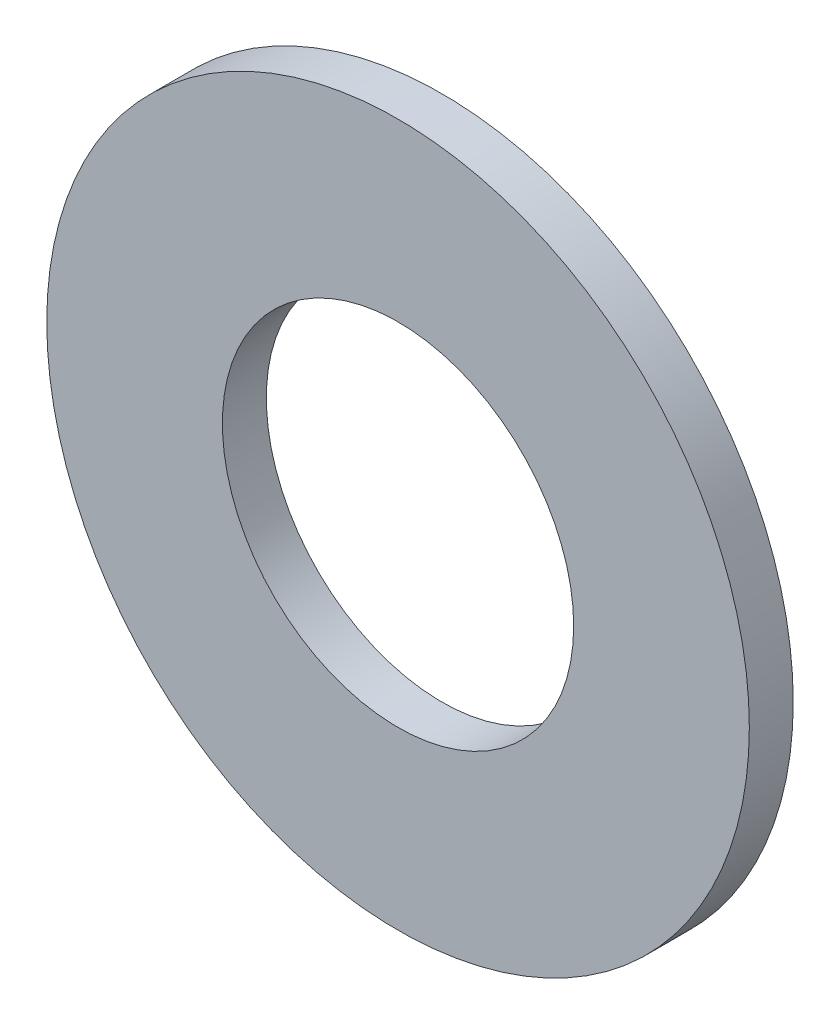
ISO-10303-21;
HEADER;
FILE_DESCRIPTION(('STEP AP214'),'2;1');
FILE_NAME('part.step','',(''),(''),'','','');
FILE_SCHEMA(('AUTOMOTIVE_DESIGN { 1 0 10303 214 1 1 1 1 }'));
ENDSEC;
DATA;
#1=APPLICATION_CONTEXT('core data for automotive mechanical design processes');
#2=APPLICATION_PROTOCOL_DEFINITION('international standard','automotive_design',2000,#1);
#3=PRODUCT_CONTEXT('',#1,'mechanical');
#4=PRODUCT('Part','Part','',(#3));
#5=PRODUCT_RELATED_PRODUCT_CATEGORY('part','',(#4));
#6=PRODUCT_DEFINITION_FORMATION('','',#4);
#7=PRODUCT_DEFINITION_CONTEXT('part definition',#1,'design');
#8=PRODUCT_DEFINITION('design','',#6,#7);
#9=PRODUCT_DEFINITION_SHAPE('','',#8);
#10=(LENGTH_UNIT() NAMED_UNIT(*) SI_UNIT(.MILLI.,.METRE.));
#11=(NAMED_UNIT(*) PLANE_ANGLE_UNIT() SI_UNIT($,.RADIAN.));
#12=(NAMED_UNIT(*) SI_UNIT($,.STERADIAN.) SOLID_ANGLE_UNIT());
#13=UNCERTAINTY_MEASURE_WITH_UNIT(LENGTH_MEASURE(1.E-05),#10,'distance_accuracy_value','');
#14=(GEOMETRIC_REPRESENTATION_CONTEXT(3) GLOBAL_UNCERTAINTY_ASSIGNED_CONTEXT((#13)) GLOBAL_UNIT_ASSIGNED_CONTEXT((#10,
#11,#12)) REPRESENTATION_CONTEXT('',''));
#15=CARTESIAN_POINT('',(0.,0.,0.));
#16=DIRECTION('',(0.,0.,1.));
#17=DIRECTION('',(1.,0.,0.));
#18=AXIS2_PLACEMENT_3D('',#15,#16,#17);
#19=CARTESIAN_POINT('',(0.,0.,0.5));
#20=DIRECTION('',(0.,0.,1.));
#21=DIRECTION('',(1.,0.,0.));
#22=AXIS2_PLACEMENT_3D('',#19,#20,#21);
#23=PLANE('',#22);
#24=CARTESIAN_POINT('',(0.,0.,0.5));
#25=DIRECTION('',(0.,0.,1.));
#26=DIRECTION('',(1.,0.,0.));
#27=AXIS2_PLACEMENT_3D('',#24,#25,#26);
#28=CIRCLE('',#27,4.);
#29=CARTESIAN_POINT('',(4.,0.,0.5));
#30=VERTEX_POINT('',#29);
#31=EDGE_CURVE('E10',#30,#30,#28,.T.);
#32=ORIENTED_EDGE('',*,*,#31,.T.);
#33=EDGE_LOOP('',(#32));
#34=FACE_BOUND('',#33,.T.);
#35=CARTESIAN_POINT('',(0.,0.,0.5));
#36=DIRECTION('',(0.,0.,1.));
#37=DIRECTION('',(1.,0.,0.));
#38=AXIS2_PLACEMENT_3D('',#35,#36,#37);
#39=CIRCLE('',#38,2.);
#40=CARTESIAN_POINT('',(2.,0.,0.5));
#41=VERTEX_POINT('',#40);
#42=EDGE_CURVE('E50',#41,#41,#39,.T.);
#43=ORIENTED_EDGE('',*,*,#42,.F.);
#44=EDGE_LOOP('',(#43));
#45=FACE_BOUND('',#44,.T.);
#46=ADVANCED_FACE('F37',(#34,#45),#23,.T.);
#47=CARTESIAN_POINT('',(0.,0.,0.));
#48=DIRECTION('',(0.,0.,1.));
#49=DIRECTION('',(1.,0.,0.));
#50=AXIS2_PLACEMENT_3D('',#47,#48,#49);
#51=PLANE('',#50);
#52=CARTESIAN_POINT('',(0.,0.,0.));
#53=DIRECTION('',(0.,0.,1.));
#54=DIRECTION('',(1.,0.,0.));
#55=AXIS2_PLACEMENT_3D('',#52,#53,#54);
#56=CIRCLE('',#55,4.);
#57=CARTESIAN_POINT('',(4.,0.,0.));
#58=VERTEX_POINT('',#57);
#59=EDGE_CURVE('E41',#58,#58,#56,.T.);
#60=ORIENTED_EDGE('',*,*,#59,.F.);
#61=EDGE_LOOP('',(#60));
#62=FACE_BOUND('',#61,.T.);
#63=CARTESIAN_POINT('',(0.,0.,0.));
#64=DIRECTION('',(0.,0.,1.));
#65=DIRECTION('',(1.,0.,0.));
#66=AXIS2_PLACEMENT_3D('',#63,#64,#65);
#67=CIRCLE('',#66,2.);
#68=CARTESIAN_POINT('',(2.,0.,0.));
#69=VERTEX_POINT('',#68);
#70=EDGE_CURVE('E52',#69,#69,#67,.T.);
#71=ORIENTED_EDGE('',*,*,#70,.T.);
#72=EDGE_LOOP('',(#71));
#73=FACE_BOUND('',#72,.T.);
#74=ADVANCED_FACE('F64',(#62,#73),#51,.F.);
#75=CARTESIAN_POINT('',(0.,0.,0.5));
#76=DIRECTION('',(0.,0.,-1.));
#77=DIRECTION('',(-1.,0.,0.));
#78=AXIS2_PLACEMENT_3D('',#75,#76,#77);
#79=CYLINDRICAL_SURFACE('',#78,4.);
#80=ORIENTED_EDGE('',*,*,#31,.F.);
#81=EDGE_LOOP('',(#80));
#82=FACE_BOUND('',#81,.T.);
#83=ORIENTED_EDGE('',*,*,#59,.T.);
#84=EDGE_LOOP('',(#83));
#85=FACE_BOUND('',#84,.T.);
#86=ADVANCED_FACE('F39',(#82,#85),#79,.T.);
#87=CARTESIAN_POINT('',(0.,0.,0.5));
#88=DIRECTION('',(0.,0.,-1.));
#89=DIRECTION('',(-1.,0.,0.));
#90=AXIS2_PLACEMENT_3D('',#87,#88,#89);
#91=CYLINDRICAL_SURFACE('',#90,2.);
#92=ORIENTED_EDGE('',*,*,#42,.T.);
#93=EDGE_LOOP('',(#92));
#94=FACE_BOUND('',#93,.T.);
#95=ORIENTED_EDGE('',*,*,#70,.F.);
#96=EDGE_LOOP('',(#95));
#97=FACE_BOUND('',#96,.T.);
#98=ADVANCED_FACE('F60',(#94,#97),#91,.F.);
#99=CLOSED_SHELL('',(#46,#74,#86,#98));
#100=MANIFOLD_SOLID_BREP('B2',#99);
#101=ADVANCED_BREP_SHAPE_REPRESENTATION('',(#18,#100),#14);
#102=SHAPE_DEFINITION_REPRESENTATION(#9,#101);
ENDSEC;
END-ISO-10303-21;
